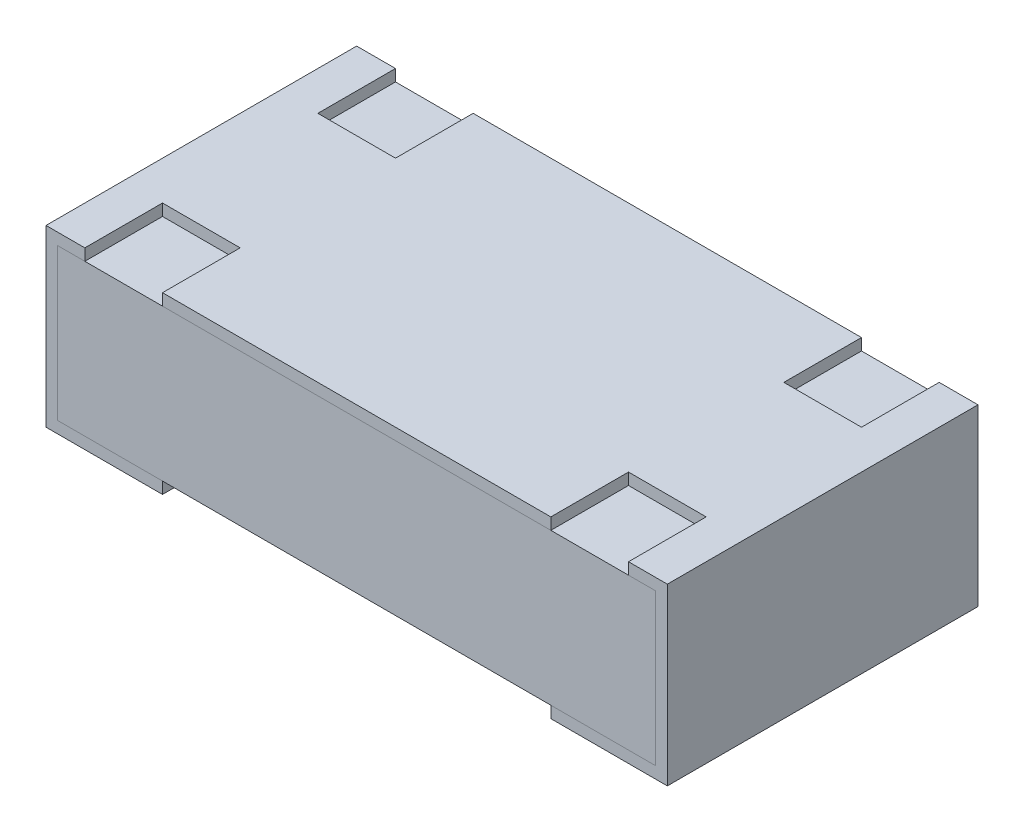
ISO-10303-21;
HEADER;
FILE_DESCRIPTION(('STEP AP214'),'2;1');
FILE_NAME('part.step','',(''),(''),'','','');
FILE_SCHEMA(('AUTOMOTIVE_DESIGN { 1 0 10303 214 1 1 1 1 }'));
ENDSEC;
DATA;
#1=APPLICATION_CONTEXT('core data for automotive mechanical design processes');
#2=APPLICATION_PROTOCOL_DEFINITION('international standard','automotive_design',2000,#1);
#3=PRODUCT_CONTEXT('',#1,'mechanical');
#4=PRODUCT('Part','Part','',(#3));
#5=PRODUCT_RELATED_PRODUCT_CATEGORY('part','',(#4));
#6=PRODUCT_DEFINITION_FORMATION('','',#4);
#7=PRODUCT_DEFINITION_CONTEXT('part definition',#1,'design');
#8=PRODUCT_DEFINITION('design','',#6,#7);
#9=PRODUCT_DEFINITION_SHAPE('','',#8);
#10=(LENGTH_UNIT() NAMED_UNIT(*) SI_UNIT(.MILLI.,.METRE.));
#11=(NAMED_UNIT(*) PLANE_ANGLE_UNIT() SI_UNIT($,.RADIAN.));
#12=(NAMED_UNIT(*) SI_UNIT($,.STERADIAN.) SOLID_ANGLE_UNIT());
#13=UNCERTAINTY_MEASURE_WITH_UNIT(LENGTH_MEASURE(1.E-05),#10,'distance_accuracy_value','');
#14=(GEOMETRIC_REPRESENTATION_CONTEXT(3) GLOBAL_UNCERTAINTY_ASSIGNED_CONTEXT((#13)) GLOBAL_UNIT_ASSIGNED_CONTEXT((#10,
#11,#12)) REPRESENTATION_CONTEXT('',''));
#15=CARTESIAN_POINT('',(0.,0.,0.));
#16=DIRECTION('',(0.,0.,1.));
#17=DIRECTION('',(1.,0.,0.));
#18=AXIS2_PLACEMENT_3D('',#15,#16,#17);
#19=CARTESIAN_POINT('',(0.77,0.42,0.));
#20=DIRECTION('',(0.,0.,1.));
#21=DIRECTION('',(1.,0.,0.));
#22=AXIS2_PLACEMENT_3D('',#19,#20,#21);
#23=PLANE('',#22);
#24=DIRECTION('',(0.,1.,0.));
#25=VECTOR('',#24,1.);
#26=CARTESIAN_POINT('',(0.77,0.03,0.));
#27=LINE('',#26,#25);
#28=CARTESIAN_POINT('',(0.77,0.03,0.));
#29=VERTEX_POINT('',#28);
#30=CARTESIAN_POINT('',(0.77,0.42,0.));
#31=VERTEX_POINT('',#30);
#32=EDGE_CURVE('P0_E70',#29,#31,#27,.T.);
#33=ORIENTED_EDGE('',*,*,#32,.F.);
#34=DIRECTION('',(1.,0.,0.));
#35=VECTOR('',#34,1.);
#36=CARTESIAN_POINT('',(0.77,0.03,0.));
#37=LINE('',#36,#35);
#38=CARTESIAN_POINT('',(-0.77,0.03,0.));
#39=VERTEX_POINT('',#38);
#40=EDGE_CURVE('P0_E27',#39,#29,#37,.T.);
#41=ORIENTED_EDGE('',*,*,#40,.F.);
#42=DIRECTION('',(0.,-1.,0.));
#43=VECTOR('',#42,1.);
#44=CARTESIAN_POINT('',(-0.77,0.03,0.));
#45=LINE('',#44,#43);
#46=CARTESIAN_POINT('',(-0.77,0.42,0.));
#47=VERTEX_POINT('',#46);
#48=EDGE_CURVE('P0_E20',#47,#39,#45,.T.);
#49=ORIENTED_EDGE('',*,*,#48,.F.);
#50=DIRECTION('',(-1.,0.,0.));
#51=VECTOR('',#50,1.);
#52=CARTESIAN_POINT('',(0.77,0.42,0.));
#53=LINE('',#52,#51);
#54=EDGE_CURVE('P0_E67',#31,#47,#53,.T.);
#55=ORIENTED_EDGE('',*,*,#54,.F.);
#56=EDGE_LOOP('',(#33,#41,#49,#55));
#57=FACE_BOUND('',#56,.T.);
#58=ADVANCED_FACE('P0_F17',(#57),#23,.F.);
#59=CARTESIAN_POINT('',(0.77,0.42,0.8));
#60=DIRECTION('',(0.,0.,1.));
#61=DIRECTION('',(1.,0.,0.));
#62=AXIS2_PLACEMENT_3D('',#59,#60,#61);
#63=PLANE('',#62);
#64=DIRECTION('',(0.,1.,0.));
#65=VECTOR('',#64,1.);
#66=CARTESIAN_POINT('',(0.77,0.03,0.8));
#67=LINE('',#66,#65);
#68=CARTESIAN_POINT('',(0.77,0.03,0.8));
#69=VERTEX_POINT('',#68);
#70=CARTESIAN_POINT('',(0.77,0.42,0.8));
#71=VERTEX_POINT('',#70);
#72=EDGE_CURVE('P0_E88',#69,#71,#67,.T.);
#73=ORIENTED_EDGE('',*,*,#72,.T.);
#74=DIRECTION('',(-1.,0.,0.));
#75=VECTOR('',#74,1.);
#76=CARTESIAN_POINT('',(0.77,0.42,0.8));
#77=LINE('',#76,#75);
#78=CARTESIAN_POINT('',(-0.77,0.42,0.8));
#79=VERTEX_POINT('',#78);
#80=EDGE_CURVE('P0_E83',#71,#79,#77,.T.);
#81=ORIENTED_EDGE('',*,*,#80,.T.);
#82=DIRECTION('',(0.,-1.,0.));
#83=VECTOR('',#82,1.);
#84=CARTESIAN_POINT('',(-0.77,0.03,0.8));
#85=LINE('',#84,#83);
#86=CARTESIAN_POINT('',(-0.77,0.03,0.8));
#87=VERTEX_POINT('',#86);
#88=EDGE_CURVE('P0_E101',#79,#87,#85,.T.);
#89=ORIENTED_EDGE('',*,*,#88,.T.);
#90=DIRECTION('',(1.,0.,0.));
#91=VECTOR('',#90,1.);
#92=CARTESIAN_POINT('',(0.77,0.03,0.8));
#93=LINE('',#92,#91);
#94=EDGE_CURVE('P0_E11',#87,#69,#93,.T.);
#95=ORIENTED_EDGE('',*,*,#94,.T.);
#96=EDGE_LOOP('',(#73,#81,#89,#95));
#97=FACE_BOUND('',#96,.T.);
#98=ADVANCED_FACE('P0_F188',(#97),#63,.T.);
#99=CARTESIAN_POINT('',(0.77,0.03,0.8));
#100=DIRECTION('',(0.,1.,0.));
#101=DIRECTION('',(1.,0.,0.));
#102=AXIS2_PLACEMENT_3D('',#99,#100,#101);
#103=PLANE('',#102);
#104=ORIENTED_EDGE('',*,*,#40,.T.);
#105=DIRECTION('',(0.,0.,-1.));
#106=VECTOR('',#105,1.);
#107=CARTESIAN_POINT('',(0.77,0.03,0.8));
#108=LINE('',#107,#106);
#109=EDGE_CURVE('P0_E77',#69,#29,#108,.T.);
#110=ORIENTED_EDGE('',*,*,#109,.F.);
#111=ORIENTED_EDGE('',*,*,#94,.F.);
#112=DIRECTION('',(0.,0.,-1.));
#113=VECTOR('',#112,1.);
#114=CARTESIAN_POINT('',(-0.77,0.03,0.8));
#115=LINE('',#114,#113);
#116=EDGE_CURVE('P0_E98',#87,#39,#115,.T.);
#117=ORIENTED_EDGE('',*,*,#116,.T.);
#118=EDGE_LOOP('',(#104,#110,#111,#117));
#119=FACE_BOUND('',#118,.T.);
#120=ADVANCED_FACE('P0_F114',(#119),#103,.F.);
#121=CARTESIAN_POINT('',(-0.77,0.03,0.8));
#122=DIRECTION('',(1.,0.,0.));
#123=DIRECTION('',(0.,1.,0.));
#124=AXIS2_PLACEMENT_3D('',#121,#122,#123);
#125=PLANE('',#124);
#126=ORIENTED_EDGE('',*,*,#48,.T.);
#127=ORIENTED_EDGE('',*,*,#116,.F.);
#128=ORIENTED_EDGE('',*,*,#88,.F.);
#129=DIRECTION('',(0.,0.,-1.));
#130=VECTOR('',#129,1.);
#131=CARTESIAN_POINT('',(-0.77,0.42,0.8));
#132=LINE('',#131,#130);
#133=EDGE_CURVE('P0_E76',#79,#47,#132,.T.);
#134=ORIENTED_EDGE('',*,*,#133,.T.);
#135=EDGE_LOOP('',(#126,#127,#128,#134));
#136=FACE_BOUND('',#135,.T.);
#137=ADVANCED_FACE('P0_F117',(#136),#125,.F.);
#138=CARTESIAN_POINT('',(0.77,0.42,0.8));
#139=DIRECTION('',(0.,-1.,0.));
#140=DIRECTION('',(0.,0.,-1.));
#141=AXIS2_PLACEMENT_3D('',#138,#139,#140);
#142=PLANE('',#141);
#143=ORIENTED_EDGE('',*,*,#54,.T.);
#144=ORIENTED_EDGE('',*,*,#133,.F.);
#145=ORIENTED_EDGE('',*,*,#80,.F.);
#146=DIRECTION('',(0.,0.,-1.));
#147=VECTOR('',#146,1.);
#148=CARTESIAN_POINT('',(0.77,0.42,0.8));
#149=LINE('',#148,#147);
#150=EDGE_CURVE('P0_E80',#71,#31,#149,.T.);
#151=ORIENTED_EDGE('',*,*,#150,.T.);
#152=EDGE_LOOP('',(#143,#144,#145,#151));
#153=FACE_BOUND('',#152,.T.);
#154=ADVANCED_FACE('P0_F81',(#153),#142,.F.);
#155=CARTESIAN_POINT('',(0.77,0.03,0.8));
#156=DIRECTION('',(-1.,0.,0.));
#157=DIRECTION('',(0.,0.,1.));
#158=AXIS2_PLACEMENT_3D('',#155,#156,#157);
#159=PLANE('',#158);
#160=ORIENTED_EDGE('',*,*,#32,.T.);
#161=ORIENTED_EDGE('',*,*,#150,.F.);
#162=ORIENTED_EDGE('',*,*,#72,.F.);
#163=ORIENTED_EDGE('',*,*,#109,.T.);
#164=EDGE_LOOP('',(#160,#161,#162,#163));
#165=FACE_BOUND('',#164,.T.);
#166=ADVANCED_FACE('P0_F91',(#165),#159,.F.);
#167=CLOSED_SHELL('',(#58,#98,#120,#137,#154,#166));
#168=MANIFOLD_SOLID_BREP('P0_B1',#167);
#169=CARTESIAN_POINT('',(0.7,0.42,0.6));
#170=DIRECTION('',(1.,0.,0.));
#171=DIRECTION('',(0.,1.,0.));
#172=AXIS2_PLACEMENT_3D('',#169,#170,#171);
#173=PLANE('',#172);
#174=DIRECTION('',(0.,0.,-1.));
#175=VECTOR('',#174,1.);
#176=CARTESIAN_POINT('',(0.7,0.45,0.6));
#177=LINE('',#176,#175);
#178=CARTESIAN_POINT('',(0.7,0.45,0.8));
#179=VERTEX_POINT('',#178);
#180=CARTESIAN_POINT('',(0.7,0.45,0.6));
#181=VERTEX_POINT('',#180);
#182=EDGE_CURVE('P1_E237',#179,#181,#177,.T.);
#183=ORIENTED_EDGE('',*,*,#182,.T.);
#184=DIRECTION('',(0.,1.,0.));
#185=VECTOR('',#184,1.);
#186=CARTESIAN_POINT('',(0.7,0.42,0.6));
#187=LINE('',#186,#185);
#188=CARTESIAN_POINT('',(0.7,0.42,0.6));
#189=VERTEX_POINT('',#188);
#190=EDGE_CURVE('P1_E10',#189,#181,#187,.T.);
#191=ORIENTED_EDGE('',*,*,#190,.F.);
#192=DIRECTION('',(0.,0.,-1.));
#193=VECTOR('',#192,1.);
#194=CARTESIAN_POINT('',(0.7,0.42,0.6));
#195=LINE('',#194,#193);
#196=CARTESIAN_POINT('',(0.7,0.42,0.8));
#197=VERTEX_POINT('',#196);
#198=EDGE_CURVE('P1_E515',#197,#189,#195,.T.);
#199=ORIENTED_EDGE('',*,*,#198,.F.);
#200=DIRECTION('',(0.,1.,0.));
#201=VECTOR('',#200,1.);
#202=CARTESIAN_POINT('',(0.7,0.42,0.8));
#203=LINE('',#202,#201);
#204=EDGE_CURVE('P1_E36',#197,#179,#203,.T.);
#205=ORIENTED_EDGE('',*,*,#204,.T.);
#206=EDGE_LOOP('',(#183,#191,#199,#205));
#207=FACE_BOUND('',#206,.T.);
#208=ADVANCED_FACE('P1_F16',(#207),#173,.F.);
#209=CARTESIAN_POINT('',(0.5,0.42,0.6));
#210=DIRECTION('',(0.,0.,-1.));
#211=DIRECTION('',(0.,-1.,0.));
#212=AXIS2_PLACEMENT_3D('',#209,#210,#211);
#213=PLANE('',#212);
#214=DIRECTION('',(-1.,0.,0.));
#215=VECTOR('',#214,1.);
#216=CARTESIAN_POINT('',(0.5,0.45,0.6));
#217=LINE('',#216,#215);
#218=CARTESIAN_POINT('',(0.5,0.45,0.6));
#219=VERTEX_POINT('',#218);
#220=EDGE_CURVE('P1_E266',#181,#219,#217,.T.);
#221=ORIENTED_EDGE('',*,*,#220,.T.);
#222=DIRECTION('',(0.,1.,0.));
#223=VECTOR('',#222,1.);
#224=CARTESIAN_POINT('',(0.5,0.42,0.6));
#225=LINE('',#224,#223);
#226=CARTESIAN_POINT('',(0.5,0.42,0.6));
#227=VERTEX_POINT('',#226);
#228=EDGE_CURVE('P1_E24',#227,#219,#225,.T.);
#229=ORIENTED_EDGE('',*,*,#228,.F.);
#230=DIRECTION('',(-1.,0.,0.));
#231=VECTOR('',#230,1.);
#232=CARTESIAN_POINT('',(0.5,0.42,0.6));
#233=LINE('',#232,#231);
#234=EDGE_CURVE('P1_E391',#189,#227,#233,.T.);
#235=ORIENTED_EDGE('',*,*,#234,.F.);
#236=ORIENTED_EDGE('',*,*,#190,.T.);
#237=EDGE_LOOP('',(#221,#229,#235,#236));
#238=FACE_BOUND('',#237,.T.);
#239=ADVANCED_FACE('P1_F306',(#238),#213,.F.);
#240=CARTESIAN_POINT('',(0.5,0.42,0.8));
#241=DIRECTION('',(-1.,0.,0.));
#242=DIRECTION('',(0.,0.,1.));
#243=AXIS2_PLACEMENT_3D('',#240,#241,#242);
#244=PLANE('',#243);
#245=DIRECTION('',(0.,0.,1.));
#246=VECTOR('',#245,1.);
#247=CARTESIAN_POINT('',(0.5,0.45,0.8));
#248=LINE('',#247,#246);
#249=CARTESIAN_POINT('',(0.5,0.45,0.8));
#250=VERTEX_POINT('',#249);
#251=EDGE_CURVE('P1_E302',#219,#250,#248,.T.);
#252=ORIENTED_EDGE('',*,*,#251,.T.);
#253=DIRECTION('',(0.,1.,0.));
#254=VECTOR('',#253,1.);
#255=CARTESIAN_POINT('',(0.5,0.42,0.8));
#256=LINE('',#255,#254);
#257=CARTESIAN_POINT('',(0.5,0.42,0.8));
#258=VERTEX_POINT('',#257);
#259=EDGE_CURVE('P1_E329',#258,#250,#256,.T.);
#260=ORIENTED_EDGE('',*,*,#259,.F.);
#261=DIRECTION('',(0.,0.,1.));
#262=VECTOR('',#261,1.);
#263=CARTESIAN_POINT('',(0.5,0.42,0.8));
#264=LINE('',#263,#262);
#265=EDGE_CURVE('P1_E304',#227,#258,#264,.T.);
#266=ORIENTED_EDGE('',*,*,#265,.F.);
#267=ORIENTED_EDGE('',*,*,#228,.T.);
#268=EDGE_LOOP('',(#252,#260,#266,#267));
#269=FACE_BOUND('',#268,.T.);
#270=ADVANCED_FACE('P1_F300',(#269),#244,.F.);
#271=CARTESIAN_POINT('',(-0.5,0.42,0.8));
#272=DIRECTION('',(1.,0.,0.));
#273=DIRECTION('',(0.,1.,0.));
#274=AXIS2_PLACEMENT_3D('',#271,#272,#273);
#275=PLANE('',#274);
#276=DIRECTION('',(0.,0.,-1.));
#277=VECTOR('',#276,1.);
#278=CARTESIAN_POINT('',(-0.5,0.45,0.8));
#279=LINE('',#278,#277);
#280=CARTESIAN_POINT('',(-0.5,0.45,0.8));
#281=VERTEX_POINT('',#280);
#282=CARTESIAN_POINT('',(-0.5,0.45,0.6));
#283=VERTEX_POINT('',#282);
#284=EDGE_CURVE('P1_E320',#281,#283,#279,.T.);
#285=ORIENTED_EDGE('',*,*,#284,.T.);
#286=DIRECTION('',(0.,1.,0.));
#287=VECTOR('',#286,1.);
#288=CARTESIAN_POINT('',(-0.5,0.42,0.6));
#289=LINE('',#288,#287);
#290=CARTESIAN_POINT('',(-0.5,0.42,0.6));
#291=VERTEX_POINT('',#290);
#292=EDGE_CURVE('P1_E292',#291,#283,#289,.T.);
#293=ORIENTED_EDGE('',*,*,#292,.F.);
#294=DIRECTION('',(0.,0.,-1.));
#295=VECTOR('',#294,1.);
#296=CARTESIAN_POINT('',(-0.5,0.42,0.8));
#297=LINE('',#296,#295);
#298=CARTESIAN_POINT('',(-0.5,0.42,0.8));
#299=VERTEX_POINT('',#298);
#300=EDGE_CURVE('P1_E390',#299,#291,#297,.T.);
#301=ORIENTED_EDGE('',*,*,#300,.F.);
#302=DIRECTION('',(0.,1.,0.));
#303=VECTOR('',#302,1.);
#304=CARTESIAN_POINT('',(-0.5,0.42,0.8));
#305=LINE('',#304,#303);
#306=EDGE_CURVE('P1_E325',#299,#281,#305,.T.);
#307=ORIENTED_EDGE('',*,*,#306,.T.);
#308=EDGE_LOOP('',(#285,#293,#301,#307));
#309=FACE_BOUND('',#308,.T.);
#310=ADVANCED_FACE('P1_F854',(#309),#275,.F.);
#311=CARTESIAN_POINT('',(-0.5,0.42,0.6));
#312=DIRECTION('',(0.,0.,-1.));
#313=DIRECTION('',(0.,-1.,0.));
#314=AXIS2_PLACEMENT_3D('',#311,#312,#313);
#315=PLANE('',#314);
#316=DIRECTION('',(-1.,0.,0.));
#317=VECTOR('',#316,1.);
#318=CARTESIAN_POINT('',(-0.5,0.45,0.6));
#319=LINE('',#318,#317);
#320=CARTESIAN_POINT('',(-0.7,0.45,0.6));
#321=VERTEX_POINT('',#320);
#322=EDGE_CURVE('P1_E422',#283,#321,#319,.T.);
#323=ORIENTED_EDGE('',*,*,#322,.T.);
#324=DIRECTION('',(0.,1.,0.));
#325=VECTOR('',#324,1.);
#326=CARTESIAN_POINT('',(-0.7,0.42,0.6));
#327=LINE('',#326,#325);
#328=CARTESIAN_POINT('',(-0.7,0.42,0.6));
#329=VERTEX_POINT('',#328);
#330=EDGE_CURVE('P1_E289',#329,#321,#327,.T.);
#331=ORIENTED_EDGE('',*,*,#330,.F.);
#332=DIRECTION('',(-1.,0.,0.));
#333=VECTOR('',#332,1.);
#334=CARTESIAN_POINT('',(-0.5,0.42,0.6));
#335=LINE('',#334,#333);
#336=EDGE_CURVE('P1_E448',#291,#329,#335,.T.);
#337=ORIENTED_EDGE('',*,*,#336,.F.);
#338=ORIENTED_EDGE('',*,*,#292,.T.);
#339=EDGE_LOOP('',(#323,#331,#337,#338));
#340=FACE_BOUND('',#339,.T.);
#341=ADVANCED_FACE('P1_F848',(#340),#315,.F.);
#342=CARTESIAN_POINT('',(-0.7,0.42,0.6));
#343=DIRECTION('',(-1.,0.,0.));
#344=DIRECTION('',(0.,0.,1.));
#345=AXIS2_PLACEMENT_3D('',#342,#343,#344);
#346=PLANE('',#345);
#347=DIRECTION('',(0.,0.,1.));
#348=VECTOR('',#347,1.);
#349=CARTESIAN_POINT('',(-0.7,0.45,0.6));
#350=LINE('',#349,#348);
#351=CARTESIAN_POINT('',(-0.7,0.45,0.8));
#352=VERTEX_POINT('',#351);
#353=EDGE_CURVE('P1_E426',#321,#352,#350,.T.);
#354=ORIENTED_EDGE('',*,*,#353,.T.);
#355=DIRECTION('',(0.,1.,0.));
#356=VECTOR('',#355,1.);
#357=CARTESIAN_POINT('',(-0.7,0.42,0.8));
#358=LINE('',#357,#356);
#359=CARTESIAN_POINT('',(-0.7,0.42,0.8));
#360=VERTEX_POINT('',#359);
#361=EDGE_CURVE('P1_E381',#360,#352,#358,.T.);
#362=ORIENTED_EDGE('',*,*,#361,.F.);
#363=DIRECTION('',(0.,0.,1.));
#364=VECTOR('',#363,1.);
#365=CARTESIAN_POINT('',(-0.7,0.42,0.6));
#366=LINE('',#365,#364);
#367=EDGE_CURVE('P1_E522',#329,#360,#366,.T.);
#368=ORIENTED_EDGE('',*,*,#367,.F.);
#369=ORIENTED_EDGE('',*,*,#330,.T.);
#370=EDGE_LOOP('',(#354,#362,#368,#369));
#371=FACE_BOUND('',#370,.T.);
#372=ADVANCED_FACE('P1_F853',(#371),#346,.F.);
#373=CARTESIAN_POINT('',(-0.7,0.42,0.2));
#374=DIRECTION('',(-1.,0.,0.));
#375=DIRECTION('',(0.,0.,1.));
#376=AXIS2_PLACEMENT_3D('',#373,#374,#375);
#377=PLANE('',#376);
#378=DIRECTION('',(0.,0.,1.));
#379=VECTOR('',#378,1.);
#380=CARTESIAN_POINT('',(-0.7,0.45,0.2));
#381=LINE('',#380,#379);
#382=CARTESIAN_POINT('',(-0.7,0.45,0.));
#383=VERTEX_POINT('',#382);
#384=CARTESIAN_POINT('',(-0.7,0.45,0.2));
#385=VERTEX_POINT('',#384);
#386=EDGE_CURVE('P1_E318',#383,#385,#381,.T.);
#387=ORIENTED_EDGE('',*,*,#386,.T.);
#388=DIRECTION('',(0.,1.,0.));
#389=VECTOR('',#388,1.);
#390=CARTESIAN_POINT('',(-0.7,0.42,0.2));
#391=LINE('',#390,#389);
#392=CARTESIAN_POINT('',(-0.7,0.42,0.2));
#393=VERTEX_POINT('',#392);
#394=EDGE_CURVE('P1_E286',#393,#385,#391,.T.);
#395=ORIENTED_EDGE('',*,*,#394,.F.);
#396=DIRECTION('',(0.,0.,1.));
#397=VECTOR('',#396,1.);
#398=CARTESIAN_POINT('',(-0.7,0.42,0.2));
#399=LINE('',#398,#397);
#400=CARTESIAN_POINT('',(-0.7,0.42,0.));
#401=VERTEX_POINT('',#400);
#402=EDGE_CURVE('P1_E491',#401,#393,#399,.T.);
#403=ORIENTED_EDGE('',*,*,#402,.F.);
#404=DIRECTION('',(0.,1.,0.));
#405=VECTOR('',#404,1.);
#406=CARTESIAN_POINT('',(-0.7,0.42,0.));
#407=LINE('',#406,#405);
#408=EDGE_CURVE('P1_E273',#401,#383,#407,.T.);
#409=ORIENTED_EDGE('',*,*,#408,.T.);
#410=EDGE_LOOP('',(#387,#395,#403,#409));
#411=FACE_BOUND('',#410,.T.);
#412=ADVANCED_FACE('P1_F864',(#411),#377,.F.);
#413=CARTESIAN_POINT('',(-0.5,0.42,0.2));
#414=DIRECTION('',(0.,0.,1.));
#415=DIRECTION('',(1.,0.,0.));
#416=AXIS2_PLACEMENT_3D('',#413,#414,#415);
#417=PLANE('',#416);
#418=DIRECTION('',(1.,0.,0.));
#419=VECTOR('',#418,1.);
#420=CARTESIAN_POINT('',(-0.5,0.45,0.2));
#421=LINE('',#420,#419);
#422=CARTESIAN_POINT('',(-0.5,0.45,0.2));
#423=VERTEX_POINT('',#422);
#424=EDGE_CURVE('P1_E311',#385,#423,#421,.T.);
#425=ORIENTED_EDGE('',*,*,#424,.T.);
#426=DIRECTION('',(0.,1.,0.));
#427=VECTOR('',#426,1.);
#428=CARTESIAN_POINT('',(-0.5,0.42,0.2));
#429=LINE('',#428,#427);
#430=CARTESIAN_POINT('',(-0.5,0.42,0.2));
#431=VERTEX_POINT('',#430);
#432=EDGE_CURVE('P1_E283',#431,#423,#429,.T.);
#433=ORIENTED_EDGE('',*,*,#432,.F.);
#434=DIRECTION('',(1.,0.,0.));
#435=VECTOR('',#434,1.);
#436=CARTESIAN_POINT('',(-0.5,0.42,0.2));
#437=LINE('',#436,#435);
#438=EDGE_CURVE('P1_E415',#393,#431,#437,.T.);
#439=ORIENTED_EDGE('',*,*,#438,.F.);
#440=ORIENTED_EDGE('',*,*,#394,.T.);
#441=EDGE_LOOP('',(#425,#433,#439,#440));
#442=FACE_BOUND('',#441,.T.);
#443=ADVANCED_FACE('P1_F869',(#442),#417,.F.);
#444=CARTESIAN_POINT('',(-0.5,0.42,0.));
#445=DIRECTION('',(1.,0.,0.));
#446=DIRECTION('',(0.,1.,0.));
#447=AXIS2_PLACEMENT_3D('',#444,#445,#446);
#448=PLANE('',#447);
#449=DIRECTION('',(0.,0.,-1.));
#450=VECTOR('',#449,1.);
#451=CARTESIAN_POINT('',(-0.5,0.45,0.));
#452=LINE('',#451,#450);
#453=CARTESIAN_POINT('',(-0.5,0.45,0.));
#454=VERTEX_POINT('',#453);
#455=EDGE_CURVE('P1_E399',#423,#454,#452,.T.);
#456=ORIENTED_EDGE('',*,*,#455,.T.);
#457=DIRECTION('',(0.,1.,0.));
#458=VECTOR('',#457,1.);
#459=CARTESIAN_POINT('',(-0.5,0.42,0.));
#460=LINE('',#459,#458);
#461=CARTESIAN_POINT('',(-0.5,0.42,0.));
#462=VERTEX_POINT('',#461);
#463=EDGE_CURVE('P1_E484',#462,#454,#460,.T.);
#464=ORIENTED_EDGE('',*,*,#463,.F.);
#465=DIRECTION('',(0.,0.,-1.));
#466=VECTOR('',#465,1.);
#467=CARTESIAN_POINT('',(-0.5,0.42,0.));
#468=LINE('',#467,#466);
#469=EDGE_CURVE('P1_E341',#431,#462,#468,.T.);
#470=ORIENTED_EDGE('',*,*,#469,.F.);
#471=ORIENTED_EDGE('',*,*,#432,.T.);
#472=EDGE_LOOP('',(#456,#464,#470,#471));
#473=FACE_BOUND('',#472,.T.);
#474=ADVANCED_FACE('P1_F1031',(#473),#448,.F.);
#475=CARTESIAN_POINT('',(0.5,0.42,0.));
#476=DIRECTION('',(-1.,0.,0.));
#477=DIRECTION('',(0.,0.,1.));
#478=AXIS2_PLACEMENT_3D('',#475,#476,#477);
#479=PLANE('',#478);
#480=DIRECTION('',(0.,0.,1.));
#481=VECTOR('',#480,1.);
#482=CARTESIAN_POINT('',(0.5,0.45,0.));
#483=LINE('',#482,#481);
#484=CARTESIAN_POINT('',(0.5,0.45,0.));
#485=VERTEX_POINT('',#484);
#486=CARTESIAN_POINT('',(0.5,0.45,0.2));
#487=VERTEX_POINT('',#486);
#488=EDGE_CURVE('P1_E392',#485,#487,#483,.T.);
#489=ORIENTED_EDGE('',*,*,#488,.T.);
#490=DIRECTION('',(0.,1.,0.));
#491=VECTOR('',#490,1.);
#492=CARTESIAN_POINT('',(0.5,0.42,0.2));
#493=LINE('',#492,#491);
#494=CARTESIAN_POINT('',(0.5,0.42,0.2));
#495=VERTEX_POINT('',#494);
#496=EDGE_CURVE('P1_E280',#495,#487,#493,.T.);
#497=ORIENTED_EDGE('',*,*,#496,.F.);
#498=DIRECTION('',(0.,0.,1.));
#499=VECTOR('',#498,1.);
#500=CARTESIAN_POINT('',(0.5,0.42,0.));
#501=LINE('',#500,#499);
#502=CARTESIAN_POINT('',(0.5,0.42,0.));
#503=VERTEX_POINT('',#502);
#504=EDGE_CURVE('P1_E336',#503,#495,#501,.T.);
#505=ORIENTED_EDGE('',*,*,#504,.F.);
#506=DIRECTION('',(0.,1.,0.));
#507=VECTOR('',#506,1.);
#508=CARTESIAN_POINT('',(0.5,0.42,0.));
#509=LINE('',#508,#507);
#510=EDGE_CURVE('P1_E375',#503,#485,#509,.T.);
#511=ORIENTED_EDGE('',*,*,#510,.T.);
#512=EDGE_LOOP('',(#489,#497,#505,#511));
#513=FACE_BOUND('',#512,.T.);
#514=ADVANCED_FACE('P1_F1019',(#513),#479,.F.);
#515=CARTESIAN_POINT('',(0.5,0.42,0.2));
#516=DIRECTION('',(0.,0.,1.));
#517=DIRECTION('',(1.,0.,0.));
#518=AXIS2_PLACEMENT_3D('',#515,#516,#517);
#519=PLANE('',#518);
#520=DIRECTION('',(1.,0.,0.));
#521=VECTOR('',#520,1.);
#522=CARTESIAN_POINT('',(0.5,0.45,0.2));
#523=LINE('',#522,#521);
#524=CARTESIAN_POINT('',(0.7,0.45,0.2));
#525=VERTEX_POINT('',#524);
#526=EDGE_CURVE('P1_E250',#487,#525,#523,.T.);
#527=ORIENTED_EDGE('',*,*,#526,.T.);
#528=DIRECTION('',(0.,1.,0.));
#529=VECTOR('',#528,1.);
#530=CARTESIAN_POINT('',(0.7,0.42,0.2));
#531=LINE('',#530,#529);
#532=CARTESIAN_POINT('',(0.7,0.42,0.2));
#533=VERTEX_POINT('',#532);
#534=EDGE_CURVE('P1_E277',#533,#525,#531,.T.);
#535=ORIENTED_EDGE('',*,*,#534,.F.);
#536=DIRECTION('',(1.,0.,0.));
#537=VECTOR('',#536,1.);
#538=CARTESIAN_POINT('',(0.5,0.42,0.2));
#539=LINE('',#538,#537);
#540=EDGE_CURVE('P1_E340',#495,#533,#539,.T.);
#541=ORIENTED_EDGE('',*,*,#540,.F.);
#542=ORIENTED_EDGE('',*,*,#496,.T.);
#543=EDGE_LOOP('',(#527,#535,#541,#542));
#544=FACE_BOUND('',#543,.T.);
#545=ADVANCED_FACE('P1_F1010',(#544),#519,.F.);
#546=CARTESIAN_POINT('',(0.7,0.42,0.2));
#547=DIRECTION('',(1.,0.,0.));
#548=DIRECTION('',(0.,1.,0.));
#549=AXIS2_PLACEMENT_3D('',#546,#547,#548);
#550=PLANE('',#549);
#551=DIRECTION('',(0.,0.,-1.));
#552=VECTOR('',#551,1.);
#553=CARTESIAN_POINT('',(0.7,0.45,0.2));
#554=LINE('',#553,#552);
#555=CARTESIAN_POINT('',(0.7,0.45,0.));
#556=VERTEX_POINT('',#555);
#557=EDGE_CURVE('P1_E240',#525,#556,#554,.T.);
#558=ORIENTED_EDGE('',*,*,#557,.T.);
#559=DIRECTION('',(0.,1.,0.));
#560=VECTOR('',#559,1.);
#561=CARTESIAN_POINT('',(0.7,0.42,0.));
#562=LINE('',#561,#560);
#563=CARTESIAN_POINT('',(0.7,0.42,0.));
#564=VERTEX_POINT('',#563);
#565=EDGE_CURVE('P1_E374',#564,#556,#562,.T.);
#566=ORIENTED_EDGE('',*,*,#565,.F.);
#567=DIRECTION('',(0.,0.,-1.));
#568=VECTOR('',#567,1.);
#569=CARTESIAN_POINT('',(0.7,0.42,0.2));
#570=LINE('',#569,#568);
#571=EDGE_CURVE('P1_E403',#533,#564,#570,.T.);
#572=ORIENTED_EDGE('',*,*,#571,.F.);
#573=ORIENTED_EDGE('',*,*,#534,.T.);
#574=EDGE_LOOP('',(#558,#566,#572,#573));
#575=FACE_BOUND('',#574,.T.);
#576=ADVANCED_FACE('P1_F998',(#575),#550,.F.);
#577=CARTESIAN_POINT('',(-0.8,0.45,0.));
#578=DIRECTION('',(0.,0.,1.));
#579=DIRECTION('',(1.,0.,0.));
#580=AXIS2_PLACEMENT_3D('',#577,#578,#579);
#581=PLANE('',#580);
#582=DIRECTION('',(-1.,0.,0.));
#583=VECTOR('',#582,1.);
#584=CARTESIAN_POINT('',(0.,0.45,0.));
#585=LINE('',#584,#583);
#586=CARTESIAN_POINT('',(-0.8,0.45,0.));
#587=VERTEX_POINT('',#586);
#588=EDGE_CURVE('P1_E335',#383,#587,#585,.T.);
#589=ORIENTED_EDGE('',*,*,#588,.F.);
#590=ORIENTED_EDGE('',*,*,#408,.F.);
#591=DIRECTION('',(1.,0.,0.));
#592=VECTOR('',#591,1.);
#593=CARTESIAN_POINT('',(0.,0.42,0.));
#594=LINE('',#593,#592);
#595=CARTESIAN_POINT('',(-0.77,0.42,0.));
#596=VERTEX_POINT('',#595);
#597=EDGE_CURVE('P1_E526',#596,#401,#594,.T.);
#598=ORIENTED_EDGE('',*,*,#597,.F.);
#599=DIRECTION('',(0.,1.,0.));
#600=VECTOR('',#599,1.);
#601=CARTESIAN_POINT('',(-0.77,0.42,0.));
#602=LINE('',#601,#600);
#603=CARTESIAN_POINT('',(-0.77,0.03,0.));
#604=VERTEX_POINT('',#603);
#605=EDGE_CURVE('P1_E365',#604,#596,#602,.T.);
#606=ORIENTED_EDGE('',*,*,#605,.F.);
#607=DIRECTION('',(-1.,0.,0.));
#608=VECTOR('',#607,1.);
#609=CARTESIAN_POINT('',(-0.77,0.03,0.));
#610=LINE('',#609,#608);
#611=CARTESIAN_POINT('',(-0.5,0.03,0.));
#612=VERTEX_POINT('',#611);
#613=EDGE_CURVE('P1_E355',#612,#604,#610,.T.);
#614=ORIENTED_EDGE('',*,*,#613,.F.);
#615=DIRECTION('',(0.,1.,0.));
#616=VECTOR('',#615,1.);
#617=CARTESIAN_POINT('',(-0.5,0.03,0.));
#618=LINE('',#617,#616);
#619=CARTESIAN_POINT('',(-0.5,0.,0.));
#620=VERTEX_POINT('',#619);
#621=EDGE_CURVE('P1_E361',#620,#612,#618,.T.);
#622=ORIENTED_EDGE('',*,*,#621,.F.);
#623=DIRECTION('',(1.,0.,0.));
#624=VECTOR('',#623,1.);
#625=CARTESIAN_POINT('',(-0.8,0.,0.));
#626=LINE('',#625,#624);
#627=CARTESIAN_POINT('',(-0.8,0.,0.));
#628=VERTEX_POINT('',#627);
#629=EDGE_CURVE('P1_E342',#628,#620,#626,.T.);
#630=ORIENTED_EDGE('',*,*,#629,.F.);
#631=DIRECTION('',(0.,-1.,0.));
#632=VECTOR('',#631,1.);
#633=CARTESIAN_POINT('',(-0.8,0.45,0.));
#634=LINE('',#633,#632);
#635=EDGE_CURVE('P1_E350',#587,#628,#634,.T.);
#636=ORIENTED_EDGE('',*,*,#635,.F.);
#637=EDGE_LOOP('',(#589,#590,#598,#606,#614,#622,#630,#636));
#638=FACE_BOUND('',#637,.T.);
#639=ADVANCED_FACE('P1_F987',(#638),#581,.F.);
#640=CARTESIAN_POINT('',(-0.8,0.45,0.8));
#641=DIRECTION('',(0.,0.,1.));
#642=DIRECTION('',(1.,0.,0.));
#643=AXIS2_PLACEMENT_3D('',#640,#641,#642);
#644=PLANE('',#643);
#645=ORIENTED_EDGE('',*,*,#204,.F.);
#646=DIRECTION('',(1.,0.,0.));
#647=VECTOR('',#646,1.);
#648=CARTESIAN_POINT('',(0.,0.42,0.8));
#649=LINE('',#648,#647);
#650=CARTESIAN_POINT('',(0.77,0.42,0.8));
#651=VERTEX_POINT('',#650);
#652=EDGE_CURVE('P1_E511',#197,#651,#649,.T.);
#653=ORIENTED_EDGE('',*,*,#652,.T.);
#654=DIRECTION('',(0.,-1.,0.));
#655=VECTOR('',#654,1.);
#656=CARTESIAN_POINT('',(0.77,0.42,0.8));
#657=LINE('',#656,#655);
#658=CARTESIAN_POINT('',(0.77,0.03,0.8));
#659=VERTEX_POINT('',#658);
#660=EDGE_CURVE('P1_E490',#651,#659,#657,.T.);
#661=ORIENTED_EDGE('',*,*,#660,.T.);
#662=DIRECTION('',(-1.,0.,0.));
#663=VECTOR('',#662,1.);
#664=CARTESIAN_POINT('',(0.77,0.03,0.8));
#665=LINE('',#664,#663);
#666=CARTESIAN_POINT('',(0.5,0.03,0.8));
#667=VERTEX_POINT('',#666);
#668=EDGE_CURVE('P1_E541',#659,#667,#665,.T.);
#669=ORIENTED_EDGE('',*,*,#668,.T.);
#670=DIRECTION('',(0.,-1.,0.));
#671=VECTOR('',#670,1.);
#672=CARTESIAN_POINT('',(0.5,0.03,0.8));
#673=LINE('',#672,#671);
#674=CARTESIAN_POINT('',(0.5,0.,0.8));
#675=VERTEX_POINT('',#674);
#676=EDGE_CURVE('P1_E540',#667,#675,#673,.T.);
#677=ORIENTED_EDGE('',*,*,#676,.T.);
#678=DIRECTION('',(1.,0.,0.));
#679=VECTOR('',#678,1.);
#680=CARTESIAN_POINT('',(0.8,0.,0.8));
#681=LINE('',#680,#679);
#682=CARTESIAN_POINT('',(0.8,0.,0.8));
#683=VERTEX_POINT('',#682);
#684=EDGE_CURVE('P1_E246',#675,#683,#681,.T.);
#685=ORIENTED_EDGE('',*,*,#684,.T.);
#686=DIRECTION('',(0.,1.,0.));
#687=VECTOR('',#686,1.);
#688=CARTESIAN_POINT('',(0.8,0.45,0.8));
#689=LINE('',#688,#687);
#690=CARTESIAN_POINT('',(0.8,0.45,0.8));
#691=VERTEX_POINT('',#690);
#692=EDGE_CURVE('P1_E243',#683,#691,#689,.T.);
#693=ORIENTED_EDGE('',*,*,#692,.T.);
#694=DIRECTION('',(-1.,0.,0.));
#695=VECTOR('',#694,1.);
#696=CARTESIAN_POINT('',(0.,0.45,0.8));
#697=LINE('',#696,#695);
#698=EDGE_CURVE('P1_E228',#691,#179,#697,.T.);
#699=ORIENTED_EDGE('',*,*,#698,.T.);
#700=EDGE_LOOP('',(#645,#653,#661,#669,#677,#685,#693,#699));
#701=FACE_BOUND('',#700,.T.);
#702=ADVANCED_FACE('P1_F244',(#701),#644,.T.);
#703=CARTESIAN_POINT('',(0.8,0.45,0.8));
#704=DIRECTION('',(-1.,0.,0.));
#705=DIRECTION('',(0.,0.,1.));
#706=AXIS2_PLACEMENT_3D('',#703,#704,#705);
#707=PLANE('',#706);
#708=DIRECTION('',(0.,1.,0.));
#709=VECTOR('',#708,1.);
#710=CARTESIAN_POINT('',(0.8,0.45,0.));
#711=LINE('',#710,#709);
#712=CARTESIAN_POINT('',(0.8,0.,0.));
#713=VERTEX_POINT('',#712);
#714=CARTESIAN_POINT('',(0.8,0.45,0.));
#715=VERTEX_POINT('',#714);
#716=EDGE_CURVE('P1_E254',#713,#715,#711,.T.);
#717=ORIENTED_EDGE('',*,*,#716,.T.);
#718=DIRECTION('',(0.,0.,-1.));
#719=VECTOR('',#718,1.);
#720=CARTESIAN_POINT('',(0.8,0.45,0.8));
#721=LINE('',#720,#719);
#722=EDGE_CURVE('P1_E234',#691,#715,#721,.T.);
#723=ORIENTED_EDGE('',*,*,#722,.F.);
#724=ORIENTED_EDGE('',*,*,#692,.F.);
#725=DIRECTION('',(0.,0.,-1.));
#726=VECTOR('',#725,1.);
#727=CARTESIAN_POINT('',(0.8,0.,0.8));
#728=LINE('',#727,#726);
#729=EDGE_CURVE('P1_E262',#683,#713,#728,.T.);
#730=ORIENTED_EDGE('',*,*,#729,.T.);
#731=EDGE_LOOP('',(#717,#723,#724,#730));
#732=FACE_BOUND('',#731,.T.);
#733=ADVANCED_FACE('P1_F252',(#732),#707,.F.);
#734=CARTESIAN_POINT('',(0.8,0.,0.8));
#735=DIRECTION('',(0.,1.,0.));
#736=DIRECTION('',(1.,0.,0.));
#737=AXIS2_PLACEMENT_3D('',#734,#735,#736);
#738=PLANE('',#737);
#739=DIRECTION('',(1.,0.,0.));
#740=VECTOR('',#739,1.);
#741=CARTESIAN_POINT('',(0.8,0.,0.));
#742=LINE('',#741,#740);
#743=CARTESIAN_POINT('',(0.5,0.,0.));
#744=VERTEX_POINT('',#743);
#745=EDGE_CURVE('P1_E435',#744,#713,#742,.T.);
#746=ORIENTED_EDGE('',*,*,#745,.T.);
#747=ORIENTED_EDGE('',*,*,#729,.F.);
#748=ORIENTED_EDGE('',*,*,#684,.F.);
#749=DIRECTION('',(0.,0.,-1.));
#750=VECTOR('',#749,1.);
#751=CARTESIAN_POINT('',(0.5,0.,0.8));
#752=LINE('',#751,#750);
#753=EDGE_CURVE('P1_E537',#675,#744,#752,.T.);
#754=ORIENTED_EDGE('',*,*,#753,.T.);
#755=EDGE_LOOP('',(#746,#747,#748,#754));
#756=FACE_BOUND('',#755,.T.);
#757=ADVANCED_FACE('P1_F554',(#756),#738,.F.);
#758=CARTESIAN_POINT('',(0.5,0.03,0.8));
#759=DIRECTION('',(1.,0.,0.));
#760=DIRECTION('',(0.,1.,0.));
#761=AXIS2_PLACEMENT_3D('',#758,#759,#760);
#762=PLANE('',#761);
#763=DIRECTION('',(0.,-1.,0.));
#764=VECTOR('',#763,1.);
#765=CARTESIAN_POINT('',(0.5,0.03,0.));
#766=LINE('',#765,#764);
#767=CARTESIAN_POINT('',(0.5,0.03,0.));
#768=VERTEX_POINT('',#767);
#769=EDGE_CURVE('P1_E430',#768,#744,#766,.T.);
#770=ORIENTED_EDGE('',*,*,#769,.T.);
#771=ORIENTED_EDGE('',*,*,#753,.F.);
#772=ORIENTED_EDGE('',*,*,#676,.F.);
#773=DIRECTION('',(0.,0.,-1.));
#774=VECTOR('',#773,1.);
#775=CARTESIAN_POINT('',(0.5,0.03,0.8));
#776=LINE('',#775,#774);
#777=EDGE_CURVE('P1_E536',#667,#768,#776,.T.);
#778=ORIENTED_EDGE('',*,*,#777,.T.);
#779=EDGE_LOOP('',(#770,#771,#772,#778));
#780=FACE_BOUND('',#779,.T.);
#781=ADVANCED_FACE('P1_F949',(#780),#762,.F.);
#782=CARTESIAN_POINT('',(0.77,0.03,0.8));
#783=DIRECTION('',(0.,-1.,0.));
#784=DIRECTION('',(0.,0.,-1.));
#785=AXIS2_PLACEMENT_3D('',#782,#783,#784);
#786=PLANE('',#785);
#787=DIRECTION('',(-1.,0.,0.));
#788=VECTOR('',#787,1.);
#789=CARTESIAN_POINT('',(0.77,0.03,0.));
#790=LINE('',#789,#788);
#791=CARTESIAN_POINT('',(0.77,0.03,0.));
#792=VERTEX_POINT('',#791);
#793=EDGE_CURVE('P1_E434',#792,#768,#790,.T.);
#794=ORIENTED_EDGE('',*,*,#793,.T.);
#795=ORIENTED_EDGE('',*,*,#777,.F.);
#796=ORIENTED_EDGE('',*,*,#668,.F.);
#797=DIRECTION('',(0.,0.,-1.));
#798=VECTOR('',#797,1.);
#799=CARTESIAN_POINT('',(0.77,0.03,0.8));
#800=LINE('',#799,#798);
#801=EDGE_CURVE('P1_E487',#659,#792,#800,.T.);
#802=ORIENTED_EDGE('',*,*,#801,.T.);
#803=EDGE_LOOP('',(#794,#795,#796,#802));
#804=FACE_BOUND('',#803,.T.);
#805=ADVANCED_FACE('P1_F940',(#804),#786,.F.);
#806=CARTESIAN_POINT('',(0.77,0.42,0.8));
#807=DIRECTION('',(1.,0.,0.));
#808=DIRECTION('',(0.,1.,0.));
#809=AXIS2_PLACEMENT_3D('',#806,#807,#808);
#810=PLANE('',#809);
#811=DIRECTION('',(0.,-1.,0.));
#812=VECTOR('',#811,1.);
#813=CARTESIAN_POINT('',(0.77,0.42,0.));
#814=LINE('',#813,#812);
#815=CARTESIAN_POINT('',(0.77,0.42,0.));
#816=VERTEX_POINT('',#815);
#817=EDGE_CURVE('P1_E354',#816,#792,#814,.T.);
#818=ORIENTED_EDGE('',*,*,#817,.T.);
#819=ORIENTED_EDGE('',*,*,#801,.F.);
#820=ORIENTED_EDGE('',*,*,#660,.F.);
#821=DIRECTION('',(0.,0.,-1.));
#822=VECTOR('',#821,1.);
#823=CARTESIAN_POINT('',(0.77,0.42,0.8));
#824=LINE('',#823,#822);
#825=EDGE_CURVE('P1_E406',#651,#816,#824,.T.);
#826=ORIENTED_EDGE('',*,*,#825,.T.);
#827=EDGE_LOOP('',(#818,#819,#820,#826));
#828=FACE_BOUND('',#827,.T.);
#829=ADVANCED_FACE('P1_F931',(#828),#810,.F.);
#830=CARTESIAN_POINT('',(0.,0.42,0.8));
#831=DIRECTION('',(0.,1.,0.));
#832=DIRECTION('',(1.,0.,0.));
#833=AXIS2_PLACEMENT_3D('',#830,#831,#832);
#834=PLANE('',#833);
#835=ORIENTED_EDGE('',*,*,#438,.T.);
#836=ORIENTED_EDGE('',*,*,#469,.T.);
#837=DIRECTION('',(1.,0.,0.));
#838=VECTOR('',#837,1.);
#839=CARTESIAN_POINT('',(0.,0.42,0.));
#840=LINE('',#839,#838);
#841=EDGE_CURVE('P1_E480',#462,#503,#840,.T.);
#842=ORIENTED_EDGE('',*,*,#841,.T.);
#843=ORIENTED_EDGE('',*,*,#504,.T.);
#844=ORIENTED_EDGE('',*,*,#540,.T.);
#845=ORIENTED_EDGE('',*,*,#571,.T.);
#846=DIRECTION('',(1.,0.,0.));
#847=VECTOR('',#846,1.);
#848=CARTESIAN_POINT('',(0.,0.42,0.));
#849=LINE('',#848,#847);
#850=EDGE_CURVE('P1_E370',#564,#816,#849,.T.);
#851=ORIENTED_EDGE('',*,*,#850,.T.);
#852=ORIENTED_EDGE('',*,*,#825,.F.);
#853=ORIENTED_EDGE('',*,*,#652,.F.);
#854=ORIENTED_EDGE('',*,*,#198,.T.);
#855=ORIENTED_EDGE('',*,*,#234,.T.);
#856=ORIENTED_EDGE('',*,*,#265,.T.);
#857=DIRECTION('',(1.,0.,0.));
#858=VECTOR('',#857,1.);
#859=CARTESIAN_POINT('',(0.,0.42,0.8));
#860=LINE('',#859,#858);
#861=EDGE_CURVE('P1_E328',#299,#258,#860,.T.);
#862=ORIENTED_EDGE('',*,*,#861,.F.);
#863=ORIENTED_EDGE('',*,*,#300,.T.);
#864=ORIENTED_EDGE('',*,*,#336,.T.);
#865=ORIENTED_EDGE('',*,*,#367,.T.);
#866=DIRECTION('',(1.,0.,0.));
#867=VECTOR('',#866,1.);
#868=CARTESIAN_POINT('',(0.,0.42,0.8));
#869=LINE('',#868,#867);
#870=CARTESIAN_POINT('',(-0.77,0.42,0.8));
#871=VERTEX_POINT('',#870);
#872=EDGE_CURVE('P1_E476',#871,#360,#869,.T.);
#873=ORIENTED_EDGE('',*,*,#872,.F.);
#874=DIRECTION('',(0.,0.,-1.));
#875=VECTOR('',#874,1.);
#876=CARTESIAN_POINT('',(-0.77,0.42,0.8));
#877=LINE('',#876,#875);
#878=EDGE_CURVE('P1_E369',#871,#596,#877,.T.);
#879=ORIENTED_EDGE('',*,*,#878,.T.);
#880=ORIENTED_EDGE('',*,*,#597,.T.);
#881=ORIENTED_EDGE('',*,*,#402,.T.);
#882=EDGE_LOOP('',(#835,#836,#842,#843,#844,#845,#851,#852,#853,#854,#855,#856,#862,#863,#864,
#865,#873,#879,#880,#881));
#883=FACE_BOUND('',#882,.T.);
#884=ADVANCED_FACE('P1_F922',(#883),#834,.F.);
#885=CARTESIAN_POINT('',(-0.77,0.42,0.8));
#886=DIRECTION('',(-1.,0.,0.));
#887=DIRECTION('',(0.,0.,1.));
#888=AXIS2_PLACEMENT_3D('',#885,#886,#887);
#889=PLANE('',#888);
#890=ORIENTED_EDGE('',*,*,#605,.T.);
#891=ORIENTED_EDGE('',*,*,#878,.F.);
#892=DIRECTION('',(0.,1.,0.));
#893=VECTOR('',#892,1.);
#894=CARTESIAN_POINT('',(-0.77,0.42,0.8));
#895=LINE('',#894,#893);
#896=CARTESIAN_POINT('',(-0.77,0.03,0.8));
#897=VERTEX_POINT('',#896);
#898=EDGE_CURVE('P1_E472',#897,#871,#895,.T.);
#899=ORIENTED_EDGE('',*,*,#898,.F.);
#900=DIRECTION('',(0.,0.,-1.));
#901=VECTOR('',#900,1.);
#902=CARTESIAN_POINT('',(-0.77,0.03,0.8));
#903=LINE('',#902,#901);
#904=EDGE_CURVE('P1_E359',#897,#604,#903,.T.);
#905=ORIENTED_EDGE('',*,*,#904,.T.);
#906=EDGE_LOOP('',(#890,#891,#899,#905));
#907=FACE_BOUND('',#906,.T.);
#908=ADVANCED_FACE('P1_F914',(#907),#889,.F.);
#909=CARTESIAN_POINT('',(-0.77,0.03,0.8));
#910=DIRECTION('',(0.,-1.,0.));
#911=DIRECTION('',(0.,0.,-1.));
#912=AXIS2_PLACEMENT_3D('',#909,#910,#911);
#913=PLANE('',#912);
#914=ORIENTED_EDGE('',*,*,#613,.T.);
#915=ORIENTED_EDGE('',*,*,#904,.F.);
#916=DIRECTION('',(-1.,0.,0.));
#917=VECTOR('',#916,1.);
#918=CARTESIAN_POINT('',(-0.77,0.03,0.8));
#919=LINE('',#918,#917);
#920=CARTESIAN_POINT('',(-0.5,0.03,0.8));
#921=VERTEX_POINT('',#920);
#922=EDGE_CURVE('P1_E468',#921,#897,#919,.T.);
#923=ORIENTED_EDGE('',*,*,#922,.F.);
#924=DIRECTION('',(0.,0.,-1.));
#925=VECTOR('',#924,1.);
#926=CARTESIAN_POINT('',(-0.5,0.03,0.8));
#927=LINE('',#926,#925);
#928=EDGE_CURVE('P1_E360',#921,#612,#927,.T.);
#929=ORIENTED_EDGE('',*,*,#928,.T.);
#930=EDGE_LOOP('',(#914,#915,#923,#929));
#931=FACE_BOUND('',#930,.T.);
#932=ADVANCED_FACE('P1_F902',(#931),#913,.F.);
#933=CARTESIAN_POINT('',(-0.5,0.03,0.8));
#934=DIRECTION('',(-1.,0.,0.));
#935=DIRECTION('',(0.,0.,1.));
#936=AXIS2_PLACEMENT_3D('',#933,#934,#935);
#937=PLANE('',#936);
#938=ORIENTED_EDGE('',*,*,#621,.T.);
#939=ORIENTED_EDGE('',*,*,#928,.F.);
#940=DIRECTION('',(0.,1.,0.));
#941=VECTOR('',#940,1.);
#942=CARTESIAN_POINT('',(-0.5,0.03,0.8));
#943=LINE('',#942,#941);
#944=CARTESIAN_POINT('',(-0.5,0.,0.8));
#945=VERTEX_POINT('',#944);
#946=EDGE_CURVE('P1_E464',#945,#921,#943,.T.);
#947=ORIENTED_EDGE('',*,*,#946,.F.);
#948=DIRECTION('',(0.,0.,-1.));
#949=VECTOR('',#948,1.);
#950=CARTESIAN_POINT('',(-0.5,0.,0.8));
#951=LINE('',#950,#949);
#952=EDGE_CURVE('P1_E346',#945,#620,#951,.T.);
#953=ORIENTED_EDGE('',*,*,#952,.T.);
#954=EDGE_LOOP('',(#938,#939,#947,#953));
#955=FACE_BOUND('',#954,.T.);
#956=ADVANCED_FACE('P1_F794',(#955),#937,.F.);
#957=CARTESIAN_POINT('',(-0.8,0.,0.8));
#958=DIRECTION('',(0.,1.,0.));
#959=DIRECTION('',(1.,0.,0.));
#960=AXIS2_PLACEMENT_3D('',#957,#958,#959);
#961=PLANE('',#960);
#962=ORIENTED_EDGE('',*,*,#629,.T.);
#963=ORIENTED_EDGE('',*,*,#952,.F.);
#964=DIRECTION('',(1.,0.,0.));
#965=VECTOR('',#964,1.);
#966=CARTESIAN_POINT('',(-0.8,0.,0.8));
#967=LINE('',#966,#965);
#968=CARTESIAN_POINT('',(-0.8,0.,0.8));
#969=VERTEX_POINT('',#968);
#970=EDGE_CURVE('P1_E380',#969,#945,#967,.T.);
#971=ORIENTED_EDGE('',*,*,#970,.F.);
#972=DIRECTION('',(0.,0.,-1.));
#973=VECTOR('',#972,1.);
#974=CARTESIAN_POINT('',(-0.8,0.,0.8));
#975=LINE('',#974,#973);
#976=EDGE_CURVE('P1_E347',#969,#628,#975,.T.);
#977=ORIENTED_EDGE('',*,*,#976,.T.);
#978=EDGE_LOOP('',(#962,#963,#971,#977));
#979=FACE_BOUND('',#978,.T.);
#980=ADVANCED_FACE('P1_F787',(#979),#961,.F.);
#981=CARTESIAN_POINT('',(-0.8,0.45,0.8));
#982=DIRECTION('',(1.,0.,0.));
#983=DIRECTION('',(0.,1.,0.));
#984=AXIS2_PLACEMENT_3D('',#981,#982,#983);
#985=PLANE('',#984);
#986=ORIENTED_EDGE('',*,*,#635,.T.);
#987=ORIENTED_EDGE('',*,*,#976,.F.);
#988=DIRECTION('',(0.,-1.,0.));
#989=VECTOR('',#988,1.);
#990=CARTESIAN_POINT('',(-0.8,0.45,0.8));
#991=LINE('',#990,#989);
#992=CARTESIAN_POINT('',(-0.8,0.45,0.8));
#993=VERTEX_POINT('',#992);
#994=EDGE_CURVE('P1_E376',#993,#969,#991,.T.);
#995=ORIENTED_EDGE('',*,*,#994,.F.);
#996=DIRECTION('',(0.,0.,-1.));
#997=VECTOR('',#996,1.);
#998=CARTESIAN_POINT('',(-0.8,0.45,0.8));
#999=LINE('',#998,#997);
#1000=EDGE_CURVE('P1_E330',#993,#587,#999,.T.);
#1001=ORIENTED_EDGE('',*,*,#1000,.T.);
#1002=EDGE_LOOP('',(#986,#987,#995,#1001));
#1003=FACE_BOUND('',#1002,.T.);
#1004=ADVANCED_FACE('P1_F793',(#1003),#985,.F.);
#1005=CARTESIAN_POINT('',(-0.8,0.45,0.));
#1006=DIRECTION('',(0.,0.,1.));
#1007=DIRECTION('',(1.,0.,0.));
#1008=AXIS2_PLACEMENT_3D('',#1005,#1006,#1007);
#1009=PLANE('',#1008);
#1010=ORIENTED_EDGE('',*,*,#850,.F.);
#1011=ORIENTED_EDGE('',*,*,#565,.T.);
#1012=DIRECTION('',(-1.,0.,0.));
#1013=VECTOR('',#1012,1.);
#1014=CARTESIAN_POINT('',(0.,0.45,0.));
#1015=LINE('',#1014,#1013);
#1016=EDGE_CURVE('P1_E452',#715,#556,#1015,.T.);
#1017=ORIENTED_EDGE('',*,*,#1016,.F.);
#1018=ORIENTED_EDGE('',*,*,#716,.F.);
#1019=ORIENTED_EDGE('',*,*,#745,.F.);
#1020=ORIENTED_EDGE('',*,*,#769,.F.);
#1021=ORIENTED_EDGE('',*,*,#793,.F.);
#1022=ORIENTED_EDGE('',*,*,#817,.F.);
#1023=EDGE_LOOP('',(#1010,#1011,#1017,#1018,#1019,#1020,#1021,#1022));
#1024=FACE_BOUND('',#1023,.T.);
#1025=ADVANCED_FACE('P1_F559',(#1024),#1009,.F.);
#1026=CARTESIAN_POINT('',(-0.8,0.45,0.));
#1027=DIRECTION('',(0.,0.,1.));
#1028=DIRECTION('',(1.,0.,0.));
#1029=AXIS2_PLACEMENT_3D('',#1026,#1027,#1028);
#1030=PLANE('',#1029);
#1031=ORIENTED_EDGE('',*,*,#841,.F.);
#1032=ORIENTED_EDGE('',*,*,#463,.T.);
#1033=DIRECTION('',(-1.,0.,0.));
#1034=VECTOR('',#1033,1.);
#1035=CARTESIAN_POINT('',(0.,0.45,0.));
#1036=LINE('',#1035,#1034);
#1037=EDGE_CURVE('P1_E396',#485,#454,#1036,.T.);
#1038=ORIENTED_EDGE('',*,*,#1037,.F.);
#1039=ORIENTED_EDGE('',*,*,#510,.F.);
#1040=EDGE_LOOP('',(#1031,#1032,#1038,#1039));
#1041=FACE_BOUND('',#1040,.T.);
#1042=ADVANCED_FACE('P1_F818',(#1041),#1030,.F.);
#1043=CARTESIAN_POINT('',(-0.8,0.45,0.8));
#1044=DIRECTION('',(0.,0.,1.));
#1045=DIRECTION('',(1.,0.,0.));
#1046=AXIS2_PLACEMENT_3D('',#1043,#1044,#1045);
#1047=PLANE('',#1046);
#1048=ORIENTED_EDGE('',*,*,#361,.T.);
#1049=DIRECTION('',(-1.,0.,0.));
#1050=VECTOR('',#1049,1.);
#1051=CARTESIAN_POINT('',(0.,0.45,0.8));
#1052=LINE('',#1051,#1050);
#1053=EDGE_CURVE('P1_E334',#352,#993,#1052,.T.);
#1054=ORIENTED_EDGE('',*,*,#1053,.T.);
#1055=ORIENTED_EDGE('',*,*,#994,.T.);
#1056=ORIENTED_EDGE('',*,*,#970,.T.);
#1057=ORIENTED_EDGE('',*,*,#946,.T.);
#1058=ORIENTED_EDGE('',*,*,#922,.T.);
#1059=ORIENTED_EDGE('',*,*,#898,.T.);
#1060=ORIENTED_EDGE('',*,*,#872,.T.);
#1061=EDGE_LOOP('',(#1048,#1054,#1055,#1056,#1057,#1058,#1059,#1060));
#1062=FACE_BOUND('',#1061,.T.);
#1063=ADVANCED_FACE('P1_F813',(#1062),#1047,.T.);
#1064=CARTESIAN_POINT('',(-0.8,0.45,0.8));
#1065=DIRECTION('',(0.,0.,1.));
#1066=DIRECTION('',(1.,0.,0.));
#1067=AXIS2_PLACEMENT_3D('',#1064,#1065,#1066);
#1068=PLANE('',#1067);
#1069=ORIENTED_EDGE('',*,*,#259,.T.);
#1070=DIRECTION('',(-1.,0.,0.));
#1071=VECTOR('',#1070,1.);
#1072=CARTESIAN_POINT('',(0.,0.45,0.8));
#1073=LINE('',#1072,#1071);
#1074=EDGE_CURVE('P1_E309',#250,#281,#1073,.T.);
#1075=ORIENTED_EDGE('',*,*,#1074,.T.);
#1076=ORIENTED_EDGE('',*,*,#306,.F.);
#1077=ORIENTED_EDGE('',*,*,#861,.T.);
#1078=EDGE_LOOP('',(#1069,#1075,#1076,#1077));
#1079=FACE_BOUND('',#1078,.T.);
#1080=ADVANCED_FACE('P1_F809',(#1079),#1068,.T.);
#1081=CARTESIAN_POINT('',(0.,0.45,0.8));
#1082=DIRECTION('',(0.,-1.,0.));
#1083=DIRECTION('',(0.,0.,-1.));
#1084=AXIS2_PLACEMENT_3D('',#1081,#1082,#1083);
#1085=PLANE('',#1084);
#1086=ORIENTED_EDGE('',*,*,#251,.F.);
#1087=ORIENTED_EDGE('',*,*,#220,.F.);
#1088=ORIENTED_EDGE('',*,*,#182,.F.);
#1089=ORIENTED_EDGE('',*,*,#698,.F.);
#1090=ORIENTED_EDGE('',*,*,#722,.T.);
#1091=ORIENTED_EDGE('',*,*,#1016,.T.);
#1092=ORIENTED_EDGE('',*,*,#557,.F.);
#1093=ORIENTED_EDGE('',*,*,#526,.F.);
#1094=ORIENTED_EDGE('',*,*,#488,.F.);
#1095=ORIENTED_EDGE('',*,*,#1037,.T.);
#1096=ORIENTED_EDGE('',*,*,#455,.F.);
#1097=ORIENTED_EDGE('',*,*,#424,.F.);
#1098=ORIENTED_EDGE('',*,*,#386,.F.);
#1099=ORIENTED_EDGE('',*,*,#588,.T.);
#1100=ORIENTED_EDGE('',*,*,#1000,.F.);
#1101=ORIENTED_EDGE('',*,*,#1053,.F.);
#1102=ORIENTED_EDGE('',*,*,#353,.F.);
#1103=ORIENTED_EDGE('',*,*,#322,.F.);
#1104=ORIENTED_EDGE('',*,*,#284,.F.);
#1105=ORIENTED_EDGE('',*,*,#1074,.F.);
#1106=EDGE_LOOP('',(#1086,#1087,#1088,#1089,#1090,#1091,#1092,#1093,#1094,#1095,#1096,#1097,
#1098,#1099,#1100,#1101,#1102,#1103,#1104,#1105));
#1107=FACE_BOUND('',#1106,.T.);
#1108=ADVANCED_FACE('P1_F231',(#1107),#1085,.F.);
#1109=CLOSED_SHELL('',(#208,#239,#270,#310,#341,#372,#412,#443,#474,#514,#545,#576,#639,#702,
#733,#757,#781,#805,#829,#884,#908,#932,#956,#980,#1004,#1025,#1042,#1063,#1080,#1108));
#1110=MANIFOLD_SOLID_BREP('P1_B1',#1109);
#1111=ADVANCED_BREP_SHAPE_REPRESENTATION('',(#18,#168,#1110),#14);
#1112=SHAPE_DEFINITION_REPRESENTATION(#9,#1111);
ENDSEC;
END-ISO-10303-21;
